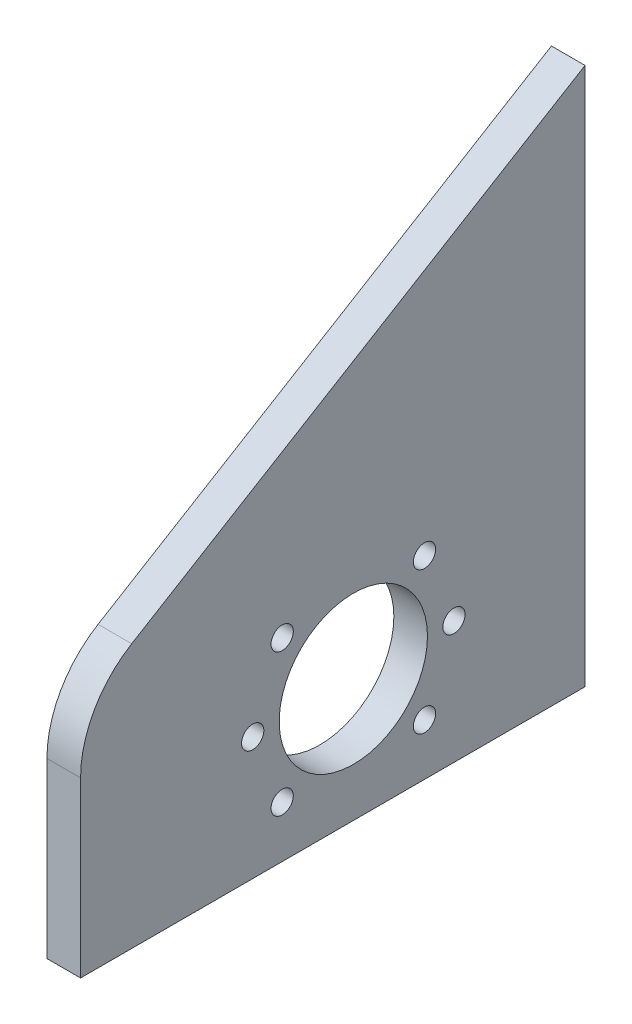
ISO-10303-21;
HEADER;
FILE_DESCRIPTION(('STEP AP214'),'2;1');
FILE_NAME('part.step','',(''),(''),'','','');
FILE_SCHEMA(('AUTOMOTIVE_DESIGN { 1 0 10303 214 1 1 1 1 }'));
ENDSEC;
DATA;
#1=APPLICATION_CONTEXT('core data for automotive mechanical design processes');
#2=APPLICATION_PROTOCOL_DEFINITION('international standard','automotive_design',2000,#1);
#3=PRODUCT_CONTEXT('',#1,'mechanical');
#4=PRODUCT('Part','Part','',(#3));
#5=PRODUCT_RELATED_PRODUCT_CATEGORY('part','',(#4));
#6=PRODUCT_DEFINITION_FORMATION('','',#4);
#7=PRODUCT_DEFINITION_CONTEXT('part definition',#1,'design');
#8=PRODUCT_DEFINITION('design','',#6,#7);
#9=PRODUCT_DEFINITION_SHAPE('','',#8);
#10=(LENGTH_UNIT() NAMED_UNIT(*) SI_UNIT(.MILLI.,.METRE.));
#11=(NAMED_UNIT(*) PLANE_ANGLE_UNIT() SI_UNIT($,.RADIAN.));
#12=(NAMED_UNIT(*) SI_UNIT($,.STERADIAN.) SOLID_ANGLE_UNIT());
#13=UNCERTAINTY_MEASURE_WITH_UNIT(LENGTH_MEASURE(1.E-05),#10,'distance_accuracy_value','');
#14=(GEOMETRIC_REPRESENTATION_CONTEXT(3) GLOBAL_UNCERTAINTY_ASSIGNED_CONTEXT((#13)) GLOBAL_UNIT_ASSIGNED_CONTEXT((#10,
#11,#12)) REPRESENTATION_CONTEXT('',''));
#15=CARTESIAN_POINT('',(0.,0.,0.));
#16=DIRECTION('',(0.,0.,1.));
#17=DIRECTION('',(1.,0.,0.));
#18=AXIS2_PLACEMENT_3D('',#15,#16,#17);
#19=CARTESIAN_POINT('',(-6.35,101.6,0.));
#20=DIRECTION('',(0.,0.,-1.));
#21=DIRECTION('',(0.,1.,0.));
#22=AXIS2_PLACEMENT_3D('',#19,#20,#21);
#23=PLANE('',#22);
#24=DIRECTION('',(0.,1.,0.));
#25=VECTOR('',#24,1.);
#26=CARTESIAN_POINT('',(0.,101.6,0.));
#27=LINE('',#26,#25);
#28=CARTESIAN_POINT('',(0.,0.,0.));
#29=VERTEX_POINT('',#28);
#30=CARTESIAN_POINT('',(0.,101.6,0.));
#31=VERTEX_POINT('',#30);
#32=EDGE_CURVE('E118',#29,#31,#27,.T.);
#33=ORIENTED_EDGE('',*,*,#32,.F.);
#34=DIRECTION('',(1.,0.,0.));
#35=VECTOR('',#34,1.);
#36=CARTESIAN_POINT('',(-6.35,0.,0.));
#37=LINE('',#36,#35);
#38=CARTESIAN_POINT('',(-6.35,0.,0.));
#39=VERTEX_POINT('',#38);
#40=EDGE_CURVE('E106',#39,#29,#37,.T.);
#41=ORIENTED_EDGE('',*,*,#40,.F.);
#42=DIRECTION('',(0.,1.,0.));
#43=VECTOR('',#42,1.);
#44=CARTESIAN_POINT('',(-6.35,101.6,0.));
#45=LINE('',#44,#43);
#46=CARTESIAN_POINT('',(-6.35,101.6,0.));
#47=VERTEX_POINT('',#46);
#48=EDGE_CURVE('E101',#39,#47,#45,.T.);
#49=ORIENTED_EDGE('',*,*,#48,.T.);
#50=DIRECTION('',(1.,0.,0.));
#51=VECTOR('',#50,1.);
#52=CARTESIAN_POINT('',(-6.35,101.6,0.));
#53=LINE('',#52,#51);
#54=EDGE_CURVE('E83',#47,#31,#53,.T.);
#55=ORIENTED_EDGE('',*,*,#54,.T.);
#56=EDGE_LOOP('',(#33,#41,#49,#55));
#57=FACE_BOUND('',#56,.T.);
#58=ADVANCED_FACE('F38',(#57),#23,.T.);
#59=CARTESIAN_POINT('',(-6.35,0.,0.));
#60=DIRECTION('',(0.,-1.,0.));
#61=DIRECTION('',(0.,0.,-1.));
#62=AXIS2_PLACEMENT_3D('',#59,#60,#61);
#63=PLANE('',#62);
#64=DIRECTION('',(0.,0.,-1.));
#65=VECTOR('',#64,1.);
#66=CARTESIAN_POINT('',(0.,0.,0.));
#67=LINE('',#66,#65);
#68=CARTESIAN_POINT('',(0.,0.,95.25));
#69=VERTEX_POINT('',#68);
#70=EDGE_CURVE('E107',#69,#29,#67,.T.);
#71=ORIENTED_EDGE('',*,*,#70,.F.);
#72=DIRECTION('',(1.,0.,0.));
#73=VECTOR('',#72,1.);
#74=CARTESIAN_POINT('',(-6.35,0.,95.25));
#75=LINE('',#74,#73);
#76=CARTESIAN_POINT('',(-6.35,0.,95.25));
#77=VERTEX_POINT('',#76);
#78=EDGE_CURVE('E94',#77,#69,#75,.T.);
#79=ORIENTED_EDGE('',*,*,#78,.F.);
#80=DIRECTION('',(0.,0.,-1.));
#81=VECTOR('',#80,1.);
#82=CARTESIAN_POINT('',(-6.35,0.,0.));
#83=LINE('',#82,#81);
#84=EDGE_CURVE('E95',#77,#39,#83,.T.);
#85=ORIENTED_EDGE('',*,*,#84,.T.);
#86=ORIENTED_EDGE('',*,*,#40,.T.);
#87=EDGE_LOOP('',(#71,#79,#85,#86));
#88=FACE_BOUND('',#87,.T.);
#89=ADVANCED_FACE('F133',(#88),#63,.T.);
#90=CARTESIAN_POINT('',(-6.35,0.,95.25));
#91=DIRECTION('',(0.,0.,1.));
#92=DIRECTION('',(0.,-1.,0.));
#93=AXIS2_PLACEMENT_3D('',#90,#91,#92);
#94=PLANE('',#93);
#95=DIRECTION('',(0.,-1.,0.));
#96=VECTOR('',#95,1.);
#97=CARTESIAN_POINT('',(0.,0.,95.25));
#98=LINE('',#97,#96);
#99=CARTESIAN_POINT('',(0.,32.7219264005611,95.25));
#100=VERTEX_POINT('',#99);
#101=EDGE_CURVE('E110',#100,#69,#98,.T.);
#102=ORIENTED_EDGE('',*,*,#101,.F.);
#103=DIRECTION('',(1.,0.,0.));
#104=VECTOR('',#103,1.);
#105=CARTESIAN_POINT('',(-6.35,32.7219264005611,95.25));
#106=LINE('',#105,#104);
#107=CARTESIAN_POINT('',(-6.35,32.7219264005611,95.25));
#108=VERTEX_POINT('',#107);
#109=EDGE_CURVE('E46',#100,#108,#106,.F.);
#110=ORIENTED_EDGE('',*,*,#109,.T.);
#111=DIRECTION('',(0.,-1.,0.));
#112=VECTOR('',#111,1.);
#113=CARTESIAN_POINT('',(-6.35,0.,95.25));
#114=LINE('',#113,#112);
#115=EDGE_CURVE('E104',#108,#77,#114,.T.);
#116=ORIENTED_EDGE('',*,*,#115,.T.);
#117=ORIENTED_EDGE('',*,*,#78,.T.);
#118=EDGE_LOOP('',(#102,#110,#116,#117));
#119=FACE_BOUND('',#118,.T.);
#120=ADVANCED_FACE('F149',(#119),#94,.T.);
#121=CARTESIAN_POINT('',(-6.35,44.,95.25));
#122=DIRECTION('',(0.,0.855704230501301,0.517465235452756));
#123=DIRECTION('',(0.,-0.517465235452756,0.855704230501301));
#124=AXIS2_PLACEMENT_3D('',#121,#122,#123);
#125=PLANE('',#124);
#126=DIRECTION('',(0.,-0.517465235452756,0.855704230501301));
#127=VECTOR('',#126,1.);
#128=CARTESIAN_POINT('',(-6.35,44.,95.25));
#129=LINE('',#128,#127);
#130=CARTESIAN_POINT('',(-6.35,49.8360110105871,85.5993047090551));
#131=VERTEX_POINT('',#130);
#132=EDGE_CURVE('E87',#47,#131,#129,.T.);
#133=ORIENTED_EDGE('',*,*,#132,.T.);
#134=DIRECTION('',(1.,0.,0.));
#135=VECTOR('',#134,1.);
#136=CARTESIAN_POINT('',(-6.35,49.8360110105871,85.5993047090551));
#137=LINE('',#136,#135);
#138=CARTESIAN_POINT('',(0.,49.8360110105871,85.5993047090551));
#139=VERTEX_POINT('',#138);
#140=EDGE_CURVE('E124',#131,#139,#137,.T.);
#141=ORIENTED_EDGE('',*,*,#140,.T.);
#142=DIRECTION('',(0.,-0.517465235452756,0.855704230501301));
#143=VECTOR('',#142,1.);
#144=CARTESIAN_POINT('',(0.,44.,95.25));
#145=LINE('',#144,#143);
#146=EDGE_CURVE('E89',#31,#139,#145,.T.);
#147=ORIENTED_EDGE('',*,*,#146,.F.);
#148=ORIENTED_EDGE('',*,*,#54,.F.);
#149=EDGE_LOOP('',(#133,#141,#147,#148));
#150=FACE_BOUND('',#149,.T.);
#151=ADVANCED_FACE('F85',(#150),#125,.T.);
#152=CARTESIAN_POINT('',(-6.35,0.,0.));
#153=DIRECTION('',(-1.,0.,0.));
#154=DIRECTION('',(0.,0.,1.));
#155=AXIS2_PLACEMENT_3D('',#152,#153,#154);
#156=PLANE('',#155);
#157=CARTESIAN_POINT('',(-6.35,36.6050288425444,30.3149711574556));
#158=DIRECTION('',(-1.,0.,0.));
#159=DIRECTION('',(0.,0.,1.));
#160=AXIS2_PLACEMENT_3D('',#157,#158,#159);
#161=CIRCLE('',#160,2.1);
#162=CARTESIAN_POINT('',(-6.35,36.6050288425444,32.4149711574556));
#163=VERTEX_POINT('',#162);
#164=EDGE_CURVE('E221',#163,#163,#161,.T.);
#165=ORIENTED_EDGE('',*,*,#164,.F.);
#166=EDGE_LOOP('',(#165));
#167=FACE_BOUND('',#166,.T.);
#168=CARTESIAN_POINT('',(-6.35,23.17,24.75));
#169=DIRECTION('',(-1.,0.,0.));
#170=DIRECTION('',(0.,0.,1.));
#171=AXIS2_PLACEMENT_3D('',#168,#169,#170);
#172=CIRCLE('',#171,2.1);
#173=CARTESIAN_POINT('',(-6.35,23.17,26.85));
#174=VERTEX_POINT('',#173);
#175=EDGE_CURVE('E218',#174,#174,#172,.T.);
#176=ORIENTED_EDGE('',*,*,#175,.F.);
#177=EDGE_LOOP('',(#176));
#178=FACE_BOUND('',#177,.T.);
#179=CARTESIAN_POINT('',(-6.35,9.73497115745559,30.3149711574556));
#180=DIRECTION('',(-1.,0.,0.));
#181=DIRECTION('',(0.,0.,1.));
#182=AXIS2_PLACEMENT_3D('',#179,#180,#181);
#183=CIRCLE('',#182,2.1);
#184=CARTESIAN_POINT('',(-6.35,9.73497115745559,32.4149711574556));
#185=VERTEX_POINT('',#184);
#186=EDGE_CURVE('E215',#185,#185,#183,.T.);
#187=ORIENTED_EDGE('',*,*,#186,.F.);
#188=EDGE_LOOP('',(#187));
#189=FACE_BOUND('',#188,.T.);
#190=CARTESIAN_POINT('',(-6.35,9.73497115745558,57.1850288425444));
#191=DIRECTION('',(-1.,0.,0.));
#192=DIRECTION('',(0.,0.,1.));
#193=AXIS2_PLACEMENT_3D('',#190,#191,#192);
#194=CIRCLE('',#193,2.09999999999999);
#195=CARTESIAN_POINT('',(-6.35,9.73497115745558,59.2850288425444));
#196=VERTEX_POINT('',#195);
#197=EDGE_CURVE('E212',#196,#196,#194,.T.);
#198=ORIENTED_EDGE('',*,*,#197,.F.);
#199=EDGE_LOOP('',(#198));
#200=FACE_BOUND('',#199,.T.);
#201=CARTESIAN_POINT('',(-6.35,23.17,62.75));
#202=DIRECTION('',(-1.,0.,0.));
#203=DIRECTION('',(0.,0.,1.));
#204=AXIS2_PLACEMENT_3D('',#201,#202,#203);
#205=CIRCLE('',#204,2.1);
#206=CARTESIAN_POINT('',(-6.35,23.17,64.85));
#207=VERTEX_POINT('',#206);
#208=EDGE_CURVE('E186',#207,#207,#205,.T.);
#209=ORIENTED_EDGE('',*,*,#208,.F.);
#210=EDGE_LOOP('',(#209));
#211=FACE_BOUND('',#210,.T.);
#212=CARTESIAN_POINT('',(-6.35,36.6050288425444,57.1850288425444));
#213=DIRECTION('',(-1.,0.,0.));
#214=DIRECTION('',(0.,0.,1.));
#215=AXIS2_PLACEMENT_3D('',#212,#213,#214);
#216=CIRCLE('',#215,2.09999999999999);
#217=CARTESIAN_POINT('',(-6.35,36.6050288425444,59.2850288425444));
#218=VERTEX_POINT('',#217);
#219=EDGE_CURVE('E195',#218,#218,#216,.T.);
#220=ORIENTED_EDGE('',*,*,#219,.F.);
#221=EDGE_LOOP('',(#220));
#222=FACE_BOUND('',#221,.T.);
#223=CARTESIAN_POINT('',(-6.35,23.17,43.75));
#224=DIRECTION('',(1.,0.,0.));
#225=DIRECTION('',(0.,0.,-1.));
#226=AXIS2_PLACEMENT_3D('',#223,#224,#225);
#227=CIRCLE('',#226,14.);
#228=CARTESIAN_POINT('',(-6.35,23.17,29.75));
#229=VERTEX_POINT('',#228);
#230=EDGE_CURVE('E120',#229,#229,#227,.T.);
#231=ORIENTED_EDGE('',*,*,#230,.T.);
#232=EDGE_LOOP('',(#231));
#233=FACE_BOUND('',#232,.T.);
#234=ORIENTED_EDGE('',*,*,#115,.F.);
#235=CARTESIAN_POINT('',(-6.35,32.7219264005611,75.25));
#236=DIRECTION('',(-1.,0.,0.));
#237=DIRECTION('',(0.,0.,1.));
#238=AXIS2_PLACEMENT_3D('',#235,#236,#237);
#239=CIRCLE('',#238,20.);
#240=EDGE_CURVE('E11',#108,#131,#239,.T.);
#241=ORIENTED_EDGE('',*,*,#240,.T.);
#242=ORIENTED_EDGE('',*,*,#132,.F.);
#243=ORIENTED_EDGE('',*,*,#48,.F.);
#244=ORIENTED_EDGE('',*,*,#84,.F.);
#245=EDGE_LOOP('',(#234,#241,#242,#243,#244));
#246=FACE_BOUND('',#245,.T.);
#247=ADVANCED_FACE('F99',(#167,#178,#189,#200,#211,#222,#233,#246),#156,.T.);
#248=CARTESIAN_POINT('',(0.,0.,0.));
#249=DIRECTION('',(-1.,0.,0.));
#250=DIRECTION('',(0.,0.,1.));
#251=AXIS2_PLACEMENT_3D('',#248,#249,#250);
#252=PLANE('',#251);
#253=CARTESIAN_POINT('',(0.,36.6050288425444,30.3149711574556));
#254=DIRECTION('',(1.,0.,0.));
#255=DIRECTION('',(0.,0.,-1.));
#256=AXIS2_PLACEMENT_3D('',#253,#254,#255);
#257=CIRCLE('',#256,2.1);
#258=CARTESIAN_POINT('',(0.,36.6050288425444,28.2149711574556));
#259=VERTEX_POINT('',#258);
#260=EDGE_CURVE('E206',#259,#259,#257,.T.);
#261=ORIENTED_EDGE('',*,*,#260,.F.);
#262=EDGE_LOOP('',(#261));
#263=FACE_BOUND('',#262,.T.);
#264=CARTESIAN_POINT('',(0.,23.17,24.75));
#265=DIRECTION('',(1.,0.,0.));
#266=DIRECTION('',(0.,0.,-1.));
#267=AXIS2_PLACEMENT_3D('',#264,#265,#266);
#268=CIRCLE('',#267,2.1);
#269=CARTESIAN_POINT('',(0.,23.17,22.65));
#270=VERTEX_POINT('',#269);
#271=EDGE_CURVE('E203',#270,#270,#268,.T.);
#272=ORIENTED_EDGE('',*,*,#271,.F.);
#273=EDGE_LOOP('',(#272));
#274=FACE_BOUND('',#273,.T.);
#275=CARTESIAN_POINT('',(0.,9.73497115745559,30.3149711574556));
#276=DIRECTION('',(1.,0.,0.));
#277=DIRECTION('',(0.,0.,-1.));
#278=AXIS2_PLACEMENT_3D('',#275,#276,#277);
#279=CIRCLE('',#278,2.1);
#280=CARTESIAN_POINT('',(0.,9.73497115745559,28.2149711574556));
#281=VERTEX_POINT('',#280);
#282=EDGE_CURVE('E198',#281,#281,#279,.T.);
#283=ORIENTED_EDGE('',*,*,#282,.F.);
#284=EDGE_LOOP('',(#283));
#285=FACE_BOUND('',#284,.T.);
#286=CARTESIAN_POINT('',(0.,9.73497115745558,57.1850288425444));
#287=DIRECTION('',(1.,0.,0.));
#288=DIRECTION('',(0.,0.,-1.));
#289=AXIS2_PLACEMENT_3D('',#286,#287,#288);
#290=CIRCLE('',#289,2.09999999999999);
#291=CARTESIAN_POINT('',(0.,9.73497115745558,55.0850288425444));
#292=VERTEX_POINT('',#291);
#293=EDGE_CURVE('E192',#292,#292,#290,.T.);
#294=ORIENTED_EDGE('',*,*,#293,.F.);
#295=EDGE_LOOP('',(#294));
#296=FACE_BOUND('',#295,.T.);
#297=CARTESIAN_POINT('',(0.,23.17,62.75));
#298=DIRECTION('',(1.,0.,0.));
#299=DIRECTION('',(0.,0.,-1.));
#300=AXIS2_PLACEMENT_3D('',#297,#298,#299);
#301=CIRCLE('',#300,2.1);
#302=CARTESIAN_POINT('',(0.,23.17,60.65));
#303=VERTEX_POINT('',#302);
#304=EDGE_CURVE('E189',#303,#303,#301,.T.);
#305=ORIENTED_EDGE('',*,*,#304,.F.);
#306=EDGE_LOOP('',(#305));
#307=FACE_BOUND('',#306,.T.);
#308=CARTESIAN_POINT('',(0.,36.6050288425444,57.1850288425444));
#309=DIRECTION('',(1.,0.,0.));
#310=DIRECTION('',(0.,0.,-1.));
#311=AXIS2_PLACEMENT_3D('',#308,#309,#310);
#312=CIRCLE('',#311,2.09999999999999);
#313=CARTESIAN_POINT('',(0.,36.6050288425444,55.0850288425444));
#314=VERTEX_POINT('',#313);
#315=EDGE_CURVE('E191',#314,#314,#312,.T.);
#316=ORIENTED_EDGE('',*,*,#315,.F.);
#317=EDGE_LOOP('',(#316));
#318=FACE_BOUND('',#317,.T.);
#319=CARTESIAN_POINT('',(0.,23.17,43.75));
#320=DIRECTION('',(1.,0.,0.));
#321=DIRECTION('',(0.,0.,-1.));
#322=AXIS2_PLACEMENT_3D('',#319,#320,#321);
#323=CIRCLE('',#322,14.);
#324=CARTESIAN_POINT('',(0.,23.17,29.75));
#325=VERTEX_POINT('',#324);
#326=EDGE_CURVE('E113',#325,#325,#323,.T.);
#327=ORIENTED_EDGE('',*,*,#326,.F.);
#328=EDGE_LOOP('',(#327));
#329=FACE_BOUND('',#328,.T.);
#330=ORIENTED_EDGE('',*,*,#146,.T.);
#331=CARTESIAN_POINT('',(0.,32.7219264005611,75.25));
#332=DIRECTION('',(-1.,0.,0.));
#333=DIRECTION('',(0.,0.,1.));
#334=AXIS2_PLACEMENT_3D('',#331,#332,#333);
#335=CIRCLE('',#334,20.);
#336=EDGE_CURVE('E60',#139,#100,#335,.F.);
#337=ORIENTED_EDGE('',*,*,#336,.T.);
#338=ORIENTED_EDGE('',*,*,#101,.T.);
#339=ORIENTED_EDGE('',*,*,#70,.T.);
#340=ORIENTED_EDGE('',*,*,#32,.T.);
#341=EDGE_LOOP('',(#330,#337,#338,#339,#340));
#342=FACE_BOUND('',#341,.T.);
#343=ADVANCED_FACE('F129',(#263,#274,#285,#296,#307,#318,#329,#342),#252,.F.);
#344=CARTESIAN_POINT('',(-6.35,32.7219264005611,75.25));
#345=DIRECTION('',(1.,0.,0.));
#346=DIRECTION('',(0.,0.,-1.));
#347=AXIS2_PLACEMENT_3D('',#344,#345,#346);
#348=CYLINDRICAL_SURFACE('',#347,20.);
#349=ORIENTED_EDGE('',*,*,#240,.F.);
#350=ORIENTED_EDGE('',*,*,#109,.F.);
#351=ORIENTED_EDGE('',*,*,#336,.F.);
#352=ORIENTED_EDGE('',*,*,#140,.F.);
#353=EDGE_LOOP('',(#349,#350,#351,#352));
#354=FACE_BOUND('',#353,.T.);
#355=ADVANCED_FACE('F40',(#354),#348,.T.);
#356=CARTESIAN_POINT('',(-6.35,23.17,43.75));
#357=DIRECTION('',(1.,0.,0.));
#358=DIRECTION('',(0.,0.,-1.));
#359=AXIS2_PLACEMENT_3D('',#356,#357,#358);
#360=CYLINDRICAL_SURFACE('',#359,14.);
#361=ORIENTED_EDGE('',*,*,#230,.F.);
#362=EDGE_LOOP('',(#361));
#363=FACE_BOUND('',#362,.T.);
#364=ORIENTED_EDGE('',*,*,#326,.T.);
#365=EDGE_LOOP('',(#364));
#366=FACE_BOUND('',#365,.T.);
#367=ADVANCED_FACE('F135',(#363,#366),#360,.F.);
#368=CARTESIAN_POINT('',(-10.,36.6050288425444,57.1850288425444));
#369=DIRECTION('',(1.,0.,0.));
#370=DIRECTION('',(0.,0.,-1.));
#371=AXIS2_PLACEMENT_3D('',#368,#369,#370);
#372=CYLINDRICAL_SURFACE('',#371,2.09999999999999);
#373=ORIENTED_EDGE('',*,*,#219,.T.);
#374=EDGE_LOOP('',(#373));
#375=FACE_BOUND('',#374,.T.);
#376=ORIENTED_EDGE('',*,*,#315,.T.);
#377=EDGE_LOOP('',(#376));
#378=FACE_BOUND('',#377,.T.);
#379=ADVANCED_FACE('F140',(#375,#378),#372,.F.);
#380=CARTESIAN_POINT('',(-10.,23.17,62.75));
#381=DIRECTION('',(1.,0.,0.));
#382=DIRECTION('',(0.,0.,-1.));
#383=AXIS2_PLACEMENT_3D('',#380,#381,#382);
#384=CYLINDRICAL_SURFACE('',#383,2.1);
#385=ORIENTED_EDGE('',*,*,#208,.T.);
#386=EDGE_LOOP('',(#385));
#387=FACE_BOUND('',#386,.T.);
#388=ORIENTED_EDGE('',*,*,#304,.T.);
#389=EDGE_LOOP('',(#388));
#390=FACE_BOUND('',#389,.T.);
#391=ADVANCED_FACE('F161',(#387,#390),#384,.F.);
#392=CARTESIAN_POINT('',(-10.,9.73497115745558,57.1850288425444));
#393=DIRECTION('',(1.,0.,0.));
#394=DIRECTION('',(0.,0.,-1.));
#395=AXIS2_PLACEMENT_3D('',#392,#393,#394);
#396=CYLINDRICAL_SURFACE('',#395,2.09999999999999);
#397=ORIENTED_EDGE('',*,*,#197,.T.);
#398=EDGE_LOOP('',(#397));
#399=FACE_BOUND('',#398,.T.);
#400=ORIENTED_EDGE('',*,*,#293,.T.);
#401=EDGE_LOOP('',(#400));
#402=FACE_BOUND('',#401,.T.);
#403=ADVANCED_FACE('F174',(#399,#402),#396,.F.);
#404=CARTESIAN_POINT('',(-10.,9.73497115745559,30.3149711574556));
#405=DIRECTION('',(1.,0.,0.));
#406=DIRECTION('',(0.,0.,-1.));
#407=AXIS2_PLACEMENT_3D('',#404,#405,#406);
#408=CYLINDRICAL_SURFACE('',#407,2.1);
#409=ORIENTED_EDGE('',*,*,#186,.T.);
#410=EDGE_LOOP('',(#409));
#411=FACE_BOUND('',#410,.T.);
#412=ORIENTED_EDGE('',*,*,#282,.T.);
#413=EDGE_LOOP('',(#412));
#414=FACE_BOUND('',#413,.T.);
#415=ADVANCED_FACE('F170',(#411,#414),#408,.F.);
#416=CARTESIAN_POINT('',(-10.,23.17,24.75));
#417=DIRECTION('',(1.,0.,0.));
#418=DIRECTION('',(0.,0.,-1.));
#419=AXIS2_PLACEMENT_3D('',#416,#417,#418);
#420=CYLINDRICAL_SURFACE('',#419,2.1);
#421=ORIENTED_EDGE('',*,*,#175,.T.);
#422=EDGE_LOOP('',(#421));
#423=FACE_BOUND('',#422,.T.);
#424=ORIENTED_EDGE('',*,*,#271,.T.);
#425=EDGE_LOOP('',(#424));
#426=FACE_BOUND('',#425,.T.);
#427=ADVANCED_FACE('F166',(#423,#426),#420,.F.);
#428=CARTESIAN_POINT('',(-10.,36.6050288425444,30.3149711574556));
#429=DIRECTION('',(1.,0.,0.));
#430=DIRECTION('',(0.,0.,-1.));
#431=AXIS2_PLACEMENT_3D('',#428,#429,#430);
#432=CYLINDRICAL_SURFACE('',#431,2.1);
#433=ORIENTED_EDGE('',*,*,#164,.T.);
#434=EDGE_LOOP('',(#433));
#435=FACE_BOUND('',#434,.T.);
#436=ORIENTED_EDGE('',*,*,#260,.T.);
#437=EDGE_LOOP('',(#436));
#438=FACE_BOUND('',#437,.T.);
#439=ADVANCED_FACE('F163',(#435,#438),#432,.F.);
#440=CLOSED_SHELL('',(#58,#89,#120,#151,#247,#343,#355,#367,#379,#391,#403,#415,#427,#439));
#441=MANIFOLD_SOLID_BREP('B2',#440);
#442=ADVANCED_BREP_SHAPE_REPRESENTATION('',(#18,#441),#14);
#443=SHAPE_DEFINITION_REPRESENTATION(#9,#442);
ENDSEC;
END-ISO-10303-21;
